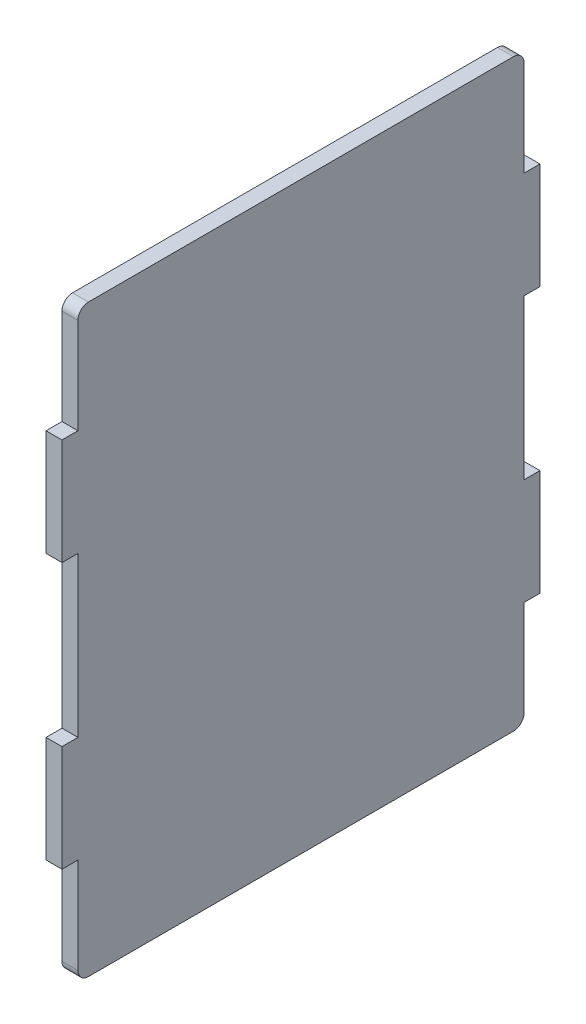
ISO-10303-21;
HEADER;
FILE_DESCRIPTION(('STEP AP214'),'2;1');
FILE_NAME('part.step','',(''),(''),'','','');
FILE_SCHEMA(('AUTOMOTIVE_DESIGN { 1 0 10303 214 1 1 1 1 }'));
ENDSEC;
DATA;
#1=APPLICATION_CONTEXT('core data for automotive mechanical design processes');
#2=APPLICATION_PROTOCOL_DEFINITION('international standard','automotive_design',2000,#1);
#3=PRODUCT_CONTEXT('',#1,'mechanical');
#4=PRODUCT('Part','Part','',(#3));
#5=PRODUCT_RELATED_PRODUCT_CATEGORY('part','',(#4));
#6=PRODUCT_DEFINITION_FORMATION('','',#4);
#7=PRODUCT_DEFINITION_CONTEXT('part definition',#1,'design');
#8=PRODUCT_DEFINITION('design','',#6,#7);
#9=PRODUCT_DEFINITION_SHAPE('','',#8);
#10=(LENGTH_UNIT() NAMED_UNIT(*) SI_UNIT(.MILLI.,.METRE.));
#11=(NAMED_UNIT(*) PLANE_ANGLE_UNIT() SI_UNIT($,.RADIAN.));
#12=(NAMED_UNIT(*) SI_UNIT($,.STERADIAN.) SOLID_ANGLE_UNIT());
#13=UNCERTAINTY_MEASURE_WITH_UNIT(LENGTH_MEASURE(1.E-05),#10,'distance_accuracy_value','');
#14=(GEOMETRIC_REPRESENTATION_CONTEXT(3) GLOBAL_UNCERTAINTY_ASSIGNED_CONTEXT((#13)) GLOBAL_UNIT_ASSIGNED_CONTEXT((#10,
#11,#12)) REPRESENTATION_CONTEXT('',''));
#15=CARTESIAN_POINT('',(0.,0.,0.));
#16=DIRECTION('',(0.,0.,1.));
#17=DIRECTION('',(1.,0.,0.));
#18=AXIS2_PLACEMENT_3D('',#15,#16,#17);
#19=CARTESIAN_POINT('',(0.,0.,1.5));
#20=DIRECTION('',(0.,0.,-1.));
#21=DIRECTION('',(-1.,0.,0.));
#22=AXIS2_PLACEMENT_3D('',#19,#20,#21);
#23=PLANE('',#22);
#24=DIRECTION('',(0.,-1.,0.));
#25=VECTOR('',#24,1.);
#26=CARTESIAN_POINT('',(-3.91489361702124,84.3977059847354,1.5));
#27=LINE('',#26,#25);
#28=CARTESIAN_POINT('',(-3.91489361702123,64.3977059847354,1.5));
#29=VERTEX_POINT('',#28);
#30=CARTESIAN_POINT('',(-3.91489361702123,44.3977059847353,1.5));
#31=VERTEX_POINT('',#30);
#32=EDGE_CURVE('E293',#29,#31,#27,.T.);
#33=ORIENTED_EDGE('',*,*,#32,.F.);
#34=DIRECTION('',(1.,0.,0.));
#35=VECTOR('',#34,1.);
#36=CARTESIAN_POINT('',(-7.00489361702124,64.3977059847354,1.5));
#37=LINE('',#36,#35);
#38=CARTESIAN_POINT('',(-6.91489361702124,64.3977059847354,1.5));
#39=VERTEX_POINT('',#38);
#40=EDGE_CURVE('E238',#39,#29,#37,.T.);
#41=ORIENTED_EDGE('',*,*,#40,.F.);
#42=DIRECTION('',(0.,-1.,0.));
#43=VECTOR('',#42,1.);
#44=CARTESIAN_POINT('',(-6.91489361702124,84.3977059847354,1.5));
#45=LINE('',#44,#43);
#46=CARTESIAN_POINT('',(-6.91489361702123,44.3977059847353,1.5));
#47=VERTEX_POINT('',#46);
#48=EDGE_CURVE('E289',#39,#47,#45,.T.);
#49=ORIENTED_EDGE('',*,*,#48,.T.);
#50=DIRECTION('',(-1.,0.,0.));
#51=VECTOR('',#50,1.);
#52=CARTESIAN_POINT('',(-3.82489361702123,44.3977059847353,1.5));
#53=LINE('',#52,#51);
#54=EDGE_CURVE('E241',#31,#47,#53,.T.);
#55=ORIENTED_EDGE('',*,*,#54,.F.);
#56=EDGE_LOOP('',(#33,#41,#49,#55));
#57=FACE_BOUND('',#56,.T.);
#58=ADVANCED_FACE('F33',(#57),#23,.F.);
#59=CARTESIAN_POINT('',(-3.91489361702121,-25.6022940152647,-198.540901486674));
#60=DIRECTION('',(0.,1.,0.));
#61=DIRECTION('',(0.,0.,1.));
#62=AXIS2_PLACEMENT_3D('',#59,#60,#61);
#63=PLANE('',#62);
#64=DIRECTION('',(0.,0.,1.));
#65=VECTOR('',#64,1.);
#66=CARTESIAN_POINT('',(-3.91489361702121,-25.6022940152647,-198.540901486674));
#67=LINE('',#66,#65);
#68=CARTESIAN_POINT('',(-3.91489361702121,-25.6022940152647,-83.5));
#69=VERTEX_POINT('',#68);
#70=CARTESIAN_POINT('',(-3.91489361702121,-25.6022940152647,-3.50000000000006));
#71=VERTEX_POINT('',#70);
#72=EDGE_CURVE('E298',#69,#71,#67,.T.);
#73=ORIENTED_EDGE('',*,*,#72,.T.);
#74=DIRECTION('',(1.,0.,0.));
#75=VECTOR('',#74,1.);
#76=CARTESIAN_POINT('',(-6.91489361702121,-25.6022940152647,-3.5));
#77=LINE('',#76,#75);
#78=CARTESIAN_POINT('',(-6.91489361702121,-25.6022940152647,-3.50000000000006));
#79=VERTEX_POINT('',#78);
#80=EDGE_CURVE('E341',#71,#79,#77,.F.);
#81=ORIENTED_EDGE('',*,*,#80,.T.);
#82=DIRECTION('',(0.,0.,1.));
#83=VECTOR('',#82,1.);
#84=CARTESIAN_POINT('',(-6.91489361702121,-25.6022940152647,-198.540901486674));
#85=LINE('',#84,#83);
#86=CARTESIAN_POINT('',(-6.91489361702121,-25.6022940152647,-83.5));
#87=VERTEX_POINT('',#86);
#88=EDGE_CURVE('E301',#87,#79,#85,.T.);
#89=ORIENTED_EDGE('',*,*,#88,.F.);
#90=DIRECTION('',(1.,0.,0.));
#91=VECTOR('',#90,1.);
#92=CARTESIAN_POINT('',(-3.91489361702121,-25.6022940152647,-83.5));
#93=LINE('',#92,#91);
#94=EDGE_CURVE('E338',#87,#69,#93,.T.);
#95=ORIENTED_EDGE('',*,*,#94,.T.);
#96=EDGE_LOOP('',(#73,#81,#89,#95));
#97=FACE_BOUND('',#96,.T.);
#98=ADVANCED_FACE('F411',(#97),#63,.F.);
#99=CARTESIAN_POINT('',(-3.91489361702124,84.3977059847354,-198.540901486674));
#100=DIRECTION('',(-1.,0.,0.));
#101=DIRECTION('',(0.,-1.,0.));
#102=AXIS2_PLACEMENT_3D('',#99,#100,#101);
#103=PLANE('',#102);
#104=DIRECTION('',(0.,1.,0.));
#105=VECTOR('',#104,1.);
#106=CARTESIAN_POINT('',(-3.91489361702123,0.,-1.5));
#107=LINE('',#106,#105);
#108=CARTESIAN_POINT('',(-3.91489361702123,-23.6022940152647,-1.5));
#109=VERTEX_POINT('',#108);
#110=CARTESIAN_POINT('',(-3.91489361702123,-5.60229401526467,-1.5));
#111=VERTEX_POINT('',#110);
#112=EDGE_CURVE('E261',#109,#111,#107,.T.);
#113=ORIENTED_EDGE('',*,*,#112,.F.);
#114=CARTESIAN_POINT('',(-3.91489361702121,-23.6022940152647,-3.5));
#115=DIRECTION('',(-1.,0.,0.));
#116=DIRECTION('',(0.,-1.,0.));
#117=AXIS2_PLACEMENT_3D('',#114,#115,#116);
#118=CIRCLE('',#117,2.);
#119=EDGE_CURVE('E336',#109,#71,#118,.F.);
#120=ORIENTED_EDGE('',*,*,#119,.T.);
#121=ORIENTED_EDGE('',*,*,#72,.F.);
#122=CARTESIAN_POINT('',(-3.91489361702121,-23.6022940152647,-83.5));
#123=DIRECTION('',(-1.,0.,0.));
#124=DIRECTION('',(0.,-1.,0.));
#125=AXIS2_PLACEMENT_3D('',#122,#123,#124);
#126=CIRCLE('',#125,2.);
#127=CARTESIAN_POINT('',(-3.9148936170212,-23.6022940152647,-85.5));
#128=VERTEX_POINT('',#127);
#129=EDGE_CURVE('E334',#69,#128,#126,.F.);
#130=ORIENTED_EDGE('',*,*,#129,.T.);
#131=DIRECTION('',(0.,1.,0.));
#132=VECTOR('',#131,1.);
#133=CARTESIAN_POINT('',(-3.91489361702121,0.,-85.5));
#134=LINE('',#133,#132);
#135=CARTESIAN_POINT('',(-3.91489361702121,-5.60229401526467,-85.5));
#136=VERTEX_POINT('',#135);
#137=EDGE_CURVE('E223',#128,#136,#134,.T.);
#138=ORIENTED_EDGE('',*,*,#137,.T.);
#139=DIRECTION('',(0.,0.,-1.));
#140=VECTOR('',#139,1.);
#141=CARTESIAN_POINT('',(-3.91489361702121,-5.60229401526467,-85.5));
#142=LINE('',#141,#140);
#143=CARTESIAN_POINT('',(-3.91489361702121,-5.60229401526467,-88.5));
#144=VERTEX_POINT('',#143);
#145=EDGE_CURVE('E227',#136,#144,#142,.T.);
#146=ORIENTED_EDGE('',*,*,#145,.T.);
#147=DIRECTION('',(0.,1.,0.));
#148=VECTOR('',#147,1.);
#149=CARTESIAN_POINT('',(-3.91489361702124,84.3977059847354,-88.5));
#150=LINE('',#149,#148);
#151=CARTESIAN_POINT('',(-3.91489361702122,14.3977059847353,-88.5));
#152=VERTEX_POINT('',#151);
#153=EDGE_CURVE('E281',#144,#152,#150,.T.);
#154=ORIENTED_EDGE('',*,*,#153,.T.);
#155=DIRECTION('',(0.,0.,1.));
#156=VECTOR('',#155,1.);
#157=CARTESIAN_POINT('',(-3.91489361702121,14.3977059847353,-85.5));
#158=LINE('',#157,#156);
#159=CARTESIAN_POINT('',(-3.91489361702121,14.3977059847353,-85.5));
#160=VERTEX_POINT('',#159);
#161=EDGE_CURVE('E222',#152,#160,#158,.T.);
#162=ORIENTED_EDGE('',*,*,#161,.T.);
#163=CARTESIAN_POINT('',(-3.91489361702121,44.3977059847353,-85.5));
#164=VERTEX_POINT('',#163);
#165=EDGE_CURVE('E201',#160,#164,#134,.T.);
#166=ORIENTED_EDGE('',*,*,#165,.T.);
#167=DIRECTION('',(0.,0.,-1.));
#168=VECTOR('',#167,1.);
#169=CARTESIAN_POINT('',(-3.91489361702121,44.3977059847353,-85.5));
#170=LINE('',#169,#168);
#171=CARTESIAN_POINT('',(-3.91489361702121,44.3977059847353,-88.5));
#172=VERTEX_POINT('',#171);
#173=EDGE_CURVE('E207',#164,#172,#170,.T.);
#174=ORIENTED_EDGE('',*,*,#173,.T.);
#175=CARTESIAN_POINT('',(-3.91489361702124,64.3977059847354,-88.5));
#176=VERTEX_POINT('',#175);
#177=EDGE_CURVE('E279',#172,#176,#150,.T.);
#178=ORIENTED_EDGE('',*,*,#177,.T.);
#179=DIRECTION('',(0.,0.,1.));
#180=VECTOR('',#179,1.);
#181=CARTESIAN_POINT('',(-3.91489361702122,64.3977059847354,-85.5));
#182=LINE('',#181,#180);
#183=CARTESIAN_POINT('',(-3.91489361702121,64.3977059847354,-85.5));
#184=VERTEX_POINT('',#183);
#185=EDGE_CURVE('E217',#176,#184,#182,.T.);
#186=ORIENTED_EDGE('',*,*,#185,.T.);
#187=CARTESIAN_POINT('',(-3.91489361702122,82.3977059847354,-85.5));
#188=VERTEX_POINT('',#187);
#189=EDGE_CURVE('E224',#184,#188,#134,.T.);
#190=ORIENTED_EDGE('',*,*,#189,.T.);
#191=CARTESIAN_POINT('',(-3.91489361702124,82.3977059847354,-83.5));
#192=DIRECTION('',(-1.,0.,0.));
#193=DIRECTION('',(0.,-1.,0.));
#194=AXIS2_PLACEMENT_3D('',#191,#192,#193);
#195=CIRCLE('',#194,2.);
#196=CARTESIAN_POINT('',(-3.91489361702124,84.3977059847354,-83.5));
#197=VERTEX_POINT('',#196);
#198=EDGE_CURVE('E332',#188,#197,#195,.F.);
#199=ORIENTED_EDGE('',*,*,#198,.T.);
#200=DIRECTION('',(0.,0.,1.));
#201=VECTOR('',#200,1.);
#202=CARTESIAN_POINT('',(-3.91489361702124,84.3977059847354,-198.540901486674));
#203=LINE('',#202,#201);
#204=CARTESIAN_POINT('',(-3.91489361702124,84.3977059847354,-3.50000000000006));
#205=VERTEX_POINT('',#204);
#206=EDGE_CURVE('E295',#197,#205,#203,.T.);
#207=ORIENTED_EDGE('',*,*,#206,.T.);
#208=CARTESIAN_POINT('',(-3.91489361702124,82.3977059847354,-3.5));
#209=DIRECTION('',(-1.,0.,0.));
#210=DIRECTION('',(0.,-1.,0.));
#211=AXIS2_PLACEMENT_3D('',#208,#209,#210);
#212=CIRCLE('',#211,2.);
#213=CARTESIAN_POINT('',(-3.91489361702124,82.3977059847354,-1.5));
#214=VERTEX_POINT('',#213);
#215=EDGE_CURVE('E330',#205,#214,#212,.F.);
#216=ORIENTED_EDGE('',*,*,#215,.T.);
#217=CARTESIAN_POINT('',(-3.91489361702123,64.3977059847354,-1.5));
#218=VERTEX_POINT('',#217);
#219=EDGE_CURVE('E260',#218,#214,#107,.T.);
#220=ORIENTED_EDGE('',*,*,#219,.F.);
#221=DIRECTION('',(0.,0.,1.));
#222=VECTOR('',#221,1.);
#223=CARTESIAN_POINT('',(-3.91489361702124,64.3977059847354,1.5));
#224=LINE('',#223,#222);
#225=EDGE_CURVE('E251',#218,#29,#224,.T.);
#226=ORIENTED_EDGE('',*,*,#225,.T.);
#227=ORIENTED_EDGE('',*,*,#32,.T.);
#228=DIRECTION('',(0.,0.,-1.));
#229=VECTOR('',#228,1.);
#230=CARTESIAN_POINT('',(-3.91489361702123,44.3977059847353,1.5));
#231=LINE('',#230,#229);
#232=CARTESIAN_POINT('',(-3.91489361702123,44.3977059847353,-1.5));
#233=VERTEX_POINT('',#232);
#234=EDGE_CURVE('E243',#31,#233,#231,.T.);
#235=ORIENTED_EDGE('',*,*,#234,.T.);
#236=CARTESIAN_POINT('',(-3.91489361702123,14.3977059847353,-1.5));
#237=VERTEX_POINT('',#236);
#238=EDGE_CURVE('E264',#237,#233,#107,.T.);
#239=ORIENTED_EDGE('',*,*,#238,.F.);
#240=DIRECTION('',(0.,0.,1.));
#241=VECTOR('',#240,1.);
#242=CARTESIAN_POINT('',(-3.91489361702123,14.3977059847353,1.5));
#243=LINE('',#242,#241);
#244=CARTESIAN_POINT('',(-3.91489361702123,14.3977059847353,1.5));
#245=VERTEX_POINT('',#244);
#246=EDGE_CURVE('E254',#237,#245,#243,.T.);
#247=ORIENTED_EDGE('',*,*,#246,.T.);
#248=CARTESIAN_POINT('',(-3.91489361702123,-5.60229401526467,1.5));
#249=VERTEX_POINT('',#248);
#250=EDGE_CURVE('E290',#245,#249,#27,.T.);
#251=ORIENTED_EDGE('',*,*,#250,.T.);
#252=DIRECTION('',(0.,0.,-1.));
#253=VECTOR('',#252,1.);
#254=CARTESIAN_POINT('',(-3.91489361702123,-5.60229401526467,1.5));
#255=LINE('',#254,#253);
#256=EDGE_CURVE('E257',#249,#111,#255,.T.);
#257=ORIENTED_EDGE('',*,*,#256,.T.);
#258=EDGE_LOOP('',(#113,#120,#121,#130,#138,#146,#154,#162,#166,#174,#178,#186,#190,#199,#207,
#216,#220,#226,#227,#235,#239,#247,#251,#257));
#259=FACE_BOUND('',#258,.T.);
#260=ADVANCED_FACE('F220',(#259),#103,.F.);
#261=CARTESIAN_POINT('',(-6.91489361702124,84.3977059847354,-198.540901486674));
#262=DIRECTION('',(0.,-1.,0.));
#263=DIRECTION('',(0.,0.,-1.));
#264=AXIS2_PLACEMENT_3D('',#261,#262,#263);
#265=PLANE('',#264);
#266=ORIENTED_EDGE('',*,*,#206,.F.);
#267=DIRECTION('',(-1.,0.,0.));
#268=VECTOR('',#267,1.);
#269=CARTESIAN_POINT('',(-6.91489361702124,84.3977059847354,-83.5));
#270=LINE('',#269,#268);
#271=CARTESIAN_POINT('',(-6.91489361702124,84.3977059847354,-83.5));
#272=VERTEX_POINT('',#271);
#273=EDGE_CURVE('E353',#197,#272,#270,.T.);
#274=ORIENTED_EDGE('',*,*,#273,.T.);
#275=DIRECTION('',(0.,0.,1.));
#276=VECTOR('',#275,1.);
#277=CARTESIAN_POINT('',(-6.91489361702124,84.3977059847354,-198.540901486674));
#278=LINE('',#277,#276);
#279=CARTESIAN_POINT('',(-6.91489361702124,84.3977059847354,-3.50000000000006));
#280=VERTEX_POINT('',#279);
#281=EDGE_CURVE('E282',#272,#280,#278,.T.);
#282=ORIENTED_EDGE('',*,*,#281,.T.);
#283=DIRECTION('',(-1.,0.,0.));
#284=VECTOR('',#283,1.);
#285=CARTESIAN_POINT('',(-3.91489361702124,84.3977059847354,-3.5));
#286=LINE('',#285,#284);
#287=EDGE_CURVE('E351',#280,#205,#286,.F.);
#288=ORIENTED_EDGE('',*,*,#287,.T.);
#289=EDGE_LOOP('',(#266,#274,#282,#288));
#290=FACE_BOUND('',#289,.T.);
#291=ADVANCED_FACE('F365',(#290),#265,.F.);
#292=CARTESIAN_POINT('',(-6.91489361702124,84.3977059847354,-198.540901486674));
#293=DIRECTION('',(-1.,0.,0.));
#294=DIRECTION('',(0.,-1.,0.));
#295=AXIS2_PLACEMENT_3D('',#292,#293,#294);
#296=PLANE('',#295);
#297=ORIENTED_EDGE('',*,*,#88,.T.);
#298=CARTESIAN_POINT('',(-6.91489361702121,-23.6022940152647,-3.5));
#299=DIRECTION('',(-1.,0.,0.));
#300=DIRECTION('',(0.,-1.,0.));
#301=AXIS2_PLACEMENT_3D('',#298,#299,#300);
#302=CIRCLE('',#301,2.);
#303=CARTESIAN_POINT('',(-6.91489361702121,-23.6022940152647,-1.5));
#304=VERTEX_POINT('',#303);
#305=EDGE_CURVE('E347',#79,#304,#302,.T.);
#306=ORIENTED_EDGE('',*,*,#305,.T.);
#307=DIRECTION('',(0.,1.,0.));
#308=VECTOR('',#307,1.);
#309=CARTESIAN_POINT('',(-6.91489361702124,84.3977059847354,-1.5));
#310=LINE('',#309,#308);
#311=CARTESIAN_POINT('',(-6.91489361702122,-5.60229401526467,-1.5));
#312=VERTEX_POINT('',#311);
#313=EDGE_CURVE('E316',#304,#312,#310,.T.);
#314=ORIENTED_EDGE('',*,*,#313,.T.);
#315=DIRECTION('',(0.,0.,-1.));
#316=VECTOR('',#315,1.);
#317=CARTESIAN_POINT('',(-6.91489361702122,-5.60229401526467,-198.540901486674));
#318=LINE('',#317,#316);
#319=CARTESIAN_POINT('',(-6.91489361702122,-5.60229401526467,1.5));
#320=VERTEX_POINT('',#319);
#321=EDGE_CURVE('E319',#320,#312,#318,.T.);
#322=ORIENTED_EDGE('',*,*,#321,.F.);
#323=CARTESIAN_POINT('',(-6.91489361702122,14.3977059847353,1.5));
#324=VERTEX_POINT('',#323);
#325=EDGE_CURVE('E278',#324,#320,#45,.T.);
#326=ORIENTED_EDGE('',*,*,#325,.F.);
#327=DIRECTION('',(0.,0.,1.));
#328=VECTOR('',#327,1.);
#329=CARTESIAN_POINT('',(-6.91489361702122,14.3977059847353,-198.540901486674));
#330=LINE('',#329,#328);
#331=CARTESIAN_POINT('',(-6.91489361702122,14.3977059847353,-1.5));
#332=VERTEX_POINT('',#331);
#333=EDGE_CURVE('E310',#332,#324,#330,.T.);
#334=ORIENTED_EDGE('',*,*,#333,.F.);
#335=CARTESIAN_POINT('',(-6.91489361702123,44.3977059847353,-1.5));
#336=VERTEX_POINT('',#335);
#337=EDGE_CURVE('E312',#332,#336,#310,.T.);
#338=ORIENTED_EDGE('',*,*,#337,.T.);
#339=DIRECTION('',(0.,0.,-1.));
#340=VECTOR('',#339,1.);
#341=CARTESIAN_POINT('',(-6.91489361702123,44.3977059847353,-198.540901486674));
#342=LINE('',#341,#340);
#343=EDGE_CURVE('E315',#47,#336,#342,.T.);
#344=ORIENTED_EDGE('',*,*,#343,.F.);
#345=ORIENTED_EDGE('',*,*,#48,.F.);
#346=DIRECTION('',(0.,0.,1.));
#347=VECTOR('',#346,1.);
#348=CARTESIAN_POINT('',(-6.91489361702124,64.3977059847354,-198.540901486674));
#349=LINE('',#348,#347);
#350=CARTESIAN_POINT('',(-6.91489361702124,64.3977059847354,-1.5));
#351=VERTEX_POINT('',#350);
#352=EDGE_CURVE('E322',#351,#39,#349,.T.);
#353=ORIENTED_EDGE('',*,*,#352,.F.);
#354=CARTESIAN_POINT('',(-6.91489361702124,82.3977059847354,-1.5));
#355=VERTEX_POINT('',#354);
#356=EDGE_CURVE('E317',#351,#355,#310,.T.);
#357=ORIENTED_EDGE('',*,*,#356,.T.);
#358=CARTESIAN_POINT('',(-6.91489361702124,82.3977059847354,-3.5));
#359=DIRECTION('',(-1.,0.,0.));
#360=DIRECTION('',(0.,-1.,0.));
#361=AXIS2_PLACEMENT_3D('',#358,#359,#360);
#362=CIRCLE('',#361,2.);
#363=EDGE_CURVE('E48',#355,#280,#362,.T.);
#364=ORIENTED_EDGE('',*,*,#363,.T.);
#365=ORIENTED_EDGE('',*,*,#281,.F.);
#366=CARTESIAN_POINT('',(-6.91489361702124,82.3977059847354,-83.5));
#367=DIRECTION('',(-1.,0.,0.));
#368=DIRECTION('',(0.,-1.,0.));
#369=AXIS2_PLACEMENT_3D('',#366,#367,#368);
#370=CIRCLE('',#369,2.);
#371=CARTESIAN_POINT('',(-6.91489361702124,82.3977059847354,-85.5));
#372=VERTEX_POINT('',#371);
#373=EDGE_CURVE('E56',#272,#372,#370,.T.);
#374=ORIENTED_EDGE('',*,*,#373,.T.);
#375=DIRECTION('',(0.,1.,0.));
#376=VECTOR('',#375,1.);
#377=CARTESIAN_POINT('',(-6.91489361702124,84.3977059847354,-85.5));
#378=LINE('',#377,#376);
#379=CARTESIAN_POINT('',(-6.91489361702124,64.3977059847354,-85.5));
#380=VERTEX_POINT('',#379);
#381=EDGE_CURVE('E326',#380,#372,#378,.T.);
#382=ORIENTED_EDGE('',*,*,#381,.F.);
#383=DIRECTION('',(0.,0.,1.));
#384=VECTOR('',#383,1.);
#385=CARTESIAN_POINT('',(-6.91489361702124,64.3977059847354,-198.540901486674));
#386=LINE('',#385,#384);
#387=CARTESIAN_POINT('',(-6.91489361702124,64.3977059847354,-88.5));
#388=VERTEX_POINT('',#387);
#389=EDGE_CURVE('E276',#388,#380,#386,.T.);
#390=ORIENTED_EDGE('',*,*,#389,.F.);
#391=DIRECTION('',(0.,1.,0.));
#392=VECTOR('',#391,1.);
#393=CARTESIAN_POINT('',(-6.91489361702124,84.3977059847354,-88.5));
#394=LINE('',#393,#392);
#395=CARTESIAN_POINT('',(-6.91489361702124,44.3977059847353,-88.5));
#396=VERTEX_POINT('',#395);
#397=EDGE_CURVE('E283',#396,#388,#394,.T.);
#398=ORIENTED_EDGE('',*,*,#397,.F.);
#399=DIRECTION('',(0.,0.,-1.));
#400=VECTOR('',#399,1.);
#401=CARTESIAN_POINT('',(-6.91489361702123,44.3977059847353,-198.540901486674));
#402=LINE('',#401,#400);
#403=CARTESIAN_POINT('',(-6.91489361702123,44.3977059847353,-85.5));
#404=VERTEX_POINT('',#403);
#405=EDGE_CURVE('E274',#404,#396,#402,.T.);
#406=ORIENTED_EDGE('',*,*,#405,.F.);
#407=CARTESIAN_POINT('',(-6.91489361702122,14.3977059847353,-85.5));
#408=VERTEX_POINT('',#407);
#409=EDGE_CURVE('E204',#408,#404,#378,.T.);
#410=ORIENTED_EDGE('',*,*,#409,.F.);
#411=DIRECTION('',(0.,0.,1.));
#412=VECTOR('',#411,1.);
#413=CARTESIAN_POINT('',(-6.91489361702122,14.3977059847353,-198.540901486674));
#414=LINE('',#413,#412);
#415=CARTESIAN_POINT('',(-6.91489361702124,14.3977059847353,-88.5));
#416=VERTEX_POINT('',#415);
#417=EDGE_CURVE('E235',#416,#408,#414,.T.);
#418=ORIENTED_EDGE('',*,*,#417,.F.);
#419=CARTESIAN_POINT('',(-6.91489361702122,-5.60229401526467,-88.5));
#420=VERTEX_POINT('',#419);
#421=EDGE_CURVE('E286',#420,#416,#394,.T.);
#422=ORIENTED_EDGE('',*,*,#421,.F.);
#423=DIRECTION('',(0.,0.,-1.));
#424=VECTOR('',#423,1.);
#425=CARTESIAN_POINT('',(-6.91489361702122,-5.60229401526467,-198.540901486674));
#426=LINE('',#425,#424);
#427=CARTESIAN_POINT('',(-6.91489361702121,-5.60229401526467,-85.5));
#428=VERTEX_POINT('',#427);
#429=EDGE_CURVE('E272',#428,#420,#426,.T.);
#430=ORIENTED_EDGE('',*,*,#429,.F.);
#431=CARTESIAN_POINT('',(-6.91489361702121,-23.6022940152647,-85.5));
#432=VERTEX_POINT('',#431);
#433=EDGE_CURVE('E325',#432,#428,#378,.T.);
#434=ORIENTED_EDGE('',*,*,#433,.F.);
#435=CARTESIAN_POINT('',(-6.91489361702121,-23.6022940152647,-83.5));
#436=DIRECTION('',(-1.,0.,0.));
#437=DIRECTION('',(0.,-1.,0.));
#438=AXIS2_PLACEMENT_3D('',#435,#436,#437);
#439=CIRCLE('',#438,2.);
#440=EDGE_CURVE('E345',#432,#87,#439,.T.);
#441=ORIENTED_EDGE('',*,*,#440,.T.);
#442=EDGE_LOOP('',(#297,#306,#314,#322,#326,#334,#338,#344,#345,#353,#357,#364,#365,#374,#382,
#390,#398,#406,#410,#418,#422,#430,#434,#441));
#443=FACE_BOUND('',#442,.T.);
#444=ADVANCED_FACE('F367',(#443),#296,.T.);
#445=CARTESIAN_POINT('',(0.,0.,-88.5));
#446=DIRECTION('',(0.,0.,1.));
#447=DIRECTION('',(1.,0.,0.));
#448=AXIS2_PLACEMENT_3D('',#445,#446,#447);
#449=PLANE('',#448);
#450=ORIENTED_EDGE('',*,*,#397,.T.);
#451=DIRECTION('',(1.,0.,0.));
#452=VECTOR('',#451,1.);
#453=CARTESIAN_POINT('',(0.,64.3977059847354,-88.5));
#454=LINE('',#453,#452);
#455=EDGE_CURVE('E307',#388,#176,#454,.T.);
#456=ORIENTED_EDGE('',*,*,#455,.T.);
#457=ORIENTED_EDGE('',*,*,#177,.F.);
#458=DIRECTION('',(-1.,0.,0.));
#459=VECTOR('',#458,1.);
#460=CARTESIAN_POINT('',(0.,44.3977059847353,-88.5));
#461=LINE('',#460,#459);
#462=EDGE_CURVE('E213',#172,#396,#461,.T.);
#463=ORIENTED_EDGE('',*,*,#462,.T.);
#464=EDGE_LOOP('',(#450,#456,#457,#463));
#465=FACE_BOUND('',#464,.T.);
#466=ADVANCED_FACE('F397',(#465),#449,.F.);
#467=ORIENTED_EDGE('',*,*,#325,.T.);
#468=DIRECTION('',(-1.,0.,0.));
#469=VECTOR('',#468,1.);
#470=CARTESIAN_POINT('',(-3.82489361702124,-5.60229401526467,1.5));
#471=LINE('',#470,#469);
#472=EDGE_CURVE('E246',#249,#320,#471,.T.);
#473=ORIENTED_EDGE('',*,*,#472,.F.);
#474=ORIENTED_EDGE('',*,*,#250,.F.);
#475=DIRECTION('',(1.,0.,0.));
#476=VECTOR('',#475,1.);
#477=CARTESIAN_POINT('',(-7.00489361702123,14.3977059847353,1.5));
#478=LINE('',#477,#476);
#479=EDGE_CURVE('E239',#324,#245,#478,.T.);
#480=ORIENTED_EDGE('',*,*,#479,.F.);
#481=EDGE_LOOP('',(#467,#473,#474,#480));
#482=FACE_BOUND('',#481,.T.);
#483=ADVANCED_FACE('F399',(#482),#23,.F.);
#484=ORIENTED_EDGE('',*,*,#153,.F.);
#485=DIRECTION('',(-1.,0.,0.));
#486=VECTOR('',#485,1.);
#487=CARTESIAN_POINT('',(0.,-5.60229401526467,-88.5));
#488=LINE('',#487,#486);
#489=EDGE_CURVE('E232',#144,#420,#488,.T.);
#490=ORIENTED_EDGE('',*,*,#489,.T.);
#491=ORIENTED_EDGE('',*,*,#421,.T.);
#492=DIRECTION('',(1.,0.,0.));
#493=VECTOR('',#492,1.);
#494=CARTESIAN_POINT('',(0.,14.3977059847353,-88.5));
#495=LINE('',#494,#493);
#496=EDGE_CURVE('E304',#416,#152,#495,.T.);
#497=ORIENTED_EDGE('',*,*,#496,.T.);
#498=EDGE_LOOP('',(#484,#490,#491,#497));
#499=FACE_BOUND('',#498,.T.);
#500=ADVANCED_FACE('F390',(#499),#449,.F.);
#501=CARTESIAN_POINT('',(-3.82489361702121,44.3977059847353,-88.5));
#502=DIRECTION('',(0.,1.,0.));
#503=DIRECTION('',(0.,0.,1.));
#504=AXIS2_PLACEMENT_3D('',#501,#502,#503);
#505=PLANE('',#504);
#506=ORIENTED_EDGE('',*,*,#405,.T.);
#507=ORIENTED_EDGE('',*,*,#462,.F.);
#508=ORIENTED_EDGE('',*,*,#173,.F.);
#509=DIRECTION('',(-1.,0.,0.));
#510=VECTOR('',#509,1.);
#511=CARTESIAN_POINT('',(-3.82489361702121,44.3977059847353,-85.5));
#512=LINE('',#511,#510);
#513=EDGE_CURVE('E196',#164,#404,#512,.T.);
#514=ORIENTED_EDGE('',*,*,#513,.T.);
#515=EDGE_LOOP('',(#506,#507,#508,#514));
#516=FACE_BOUND('',#515,.T.);
#517=ADVANCED_FACE('F211',(#516),#505,.F.);
#518=CARTESIAN_POINT('',(-7.00489361702121,14.3977059847353,-88.5));
#519=DIRECTION('',(0.,-1.,0.));
#520=DIRECTION('',(0.,0.,-1.));
#521=AXIS2_PLACEMENT_3D('',#518,#519,#520);
#522=PLANE('',#521);
#523=ORIENTED_EDGE('',*,*,#417,.T.);
#524=DIRECTION('',(1.,0.,0.));
#525=VECTOR('',#524,1.);
#526=CARTESIAN_POINT('',(-7.00489361702121,14.3977059847353,-85.5));
#527=LINE('',#526,#525);
#528=EDGE_CURVE('E383',#408,#160,#527,.T.);
#529=ORIENTED_EDGE('',*,*,#528,.T.);
#530=ORIENTED_EDGE('',*,*,#161,.F.);
#531=ORIENTED_EDGE('',*,*,#496,.F.);
#532=EDGE_LOOP('',(#523,#529,#530,#531));
#533=FACE_BOUND('',#532,.T.);
#534=ADVANCED_FACE('F503',(#533),#522,.F.);
#535=CARTESIAN_POINT('',(0.,0.,-85.5));
#536=DIRECTION('',(0.,0.,1.));
#537=DIRECTION('',(1.,0.,0.));
#538=AXIS2_PLACEMENT_3D('',#535,#536,#537);
#539=PLANE('',#538);
#540=ORIENTED_EDGE('',*,*,#409,.T.);
#541=ORIENTED_EDGE('',*,*,#513,.F.);
#542=ORIENTED_EDGE('',*,*,#165,.F.);
#543=ORIENTED_EDGE('',*,*,#528,.F.);
#544=EDGE_LOOP('',(#540,#541,#542,#543));
#545=FACE_BOUND('',#544,.T.);
#546=ADVANCED_FACE('F198',(#545),#539,.F.);
#547=CARTESIAN_POINT('',(-3.82489361702122,-5.60229401526467,-88.5));
#548=DIRECTION('',(0.,1.,0.));
#549=DIRECTION('',(0.,0.,1.));
#550=AXIS2_PLACEMENT_3D('',#547,#548,#549);
#551=PLANE('',#550);
#552=ORIENTED_EDGE('',*,*,#429,.T.);
#553=ORIENTED_EDGE('',*,*,#489,.F.);
#554=ORIENTED_EDGE('',*,*,#145,.F.);
#555=DIRECTION('',(-1.,0.,0.));
#556=VECTOR('',#555,1.);
#557=CARTESIAN_POINT('',(-3.82489361702122,-5.60229401526467,-85.5));
#558=LINE('',#557,#556);
#559=EDGE_CURVE('E270',#136,#428,#558,.T.);
#560=ORIENTED_EDGE('',*,*,#559,.T.);
#561=EDGE_LOOP('',(#552,#553,#554,#560));
#562=FACE_BOUND('',#561,.T.);
#563=ADVANCED_FACE('F381',(#562),#551,.F.);
#564=ORIENTED_EDGE('',*,*,#137,.F.);
#565=DIRECTION('',(1.,0.,0.));
#566=VECTOR('',#565,1.);
#567=CARTESIAN_POINT('',(0.,-23.6022940152647,-85.5));
#568=LINE('',#567,#566);
#569=EDGE_CURVE('E349',#128,#432,#568,.F.);
#570=ORIENTED_EDGE('',*,*,#569,.T.);
#571=ORIENTED_EDGE('',*,*,#433,.T.);
#572=ORIENTED_EDGE('',*,*,#559,.F.);
#573=EDGE_LOOP('',(#564,#570,#571,#572));
#574=FACE_BOUND('',#573,.T.);
#575=ADVANCED_FACE('F375',(#574),#539,.F.);
#576=ORIENTED_EDGE('',*,*,#381,.T.);
#577=DIRECTION('',(-1.,0.,0.));
#578=VECTOR('',#577,1.);
#579=CARTESIAN_POINT('',(0.,82.3977059847354,-85.5));
#580=LINE('',#579,#578);
#581=EDGE_CURVE('E41',#372,#188,#580,.F.);
#582=ORIENTED_EDGE('',*,*,#581,.T.);
#583=ORIENTED_EDGE('',*,*,#189,.F.);
#584=DIRECTION('',(1.,0.,0.));
#585=VECTOR('',#584,1.);
#586=CARTESIAN_POINT('',(-7.00489361702122,64.3977059847354,-85.5));
#587=LINE('',#586,#585);
#588=EDGE_CURVE('E208',#380,#184,#587,.T.);
#589=ORIENTED_EDGE('',*,*,#588,.F.);
#590=EDGE_LOOP('',(#576,#582,#583,#589));
#591=FACE_BOUND('',#590,.T.);
#592=ADVANCED_FACE('F357',(#591),#539,.F.);
#593=CARTESIAN_POINT('',(-7.00489361702122,64.3977059847354,-88.5));
#594=DIRECTION('',(0.,-1.,0.));
#595=DIRECTION('',(0.,0.,-1.));
#596=AXIS2_PLACEMENT_3D('',#593,#594,#595);
#597=PLANE('',#596);
#598=ORIENTED_EDGE('',*,*,#389,.T.);
#599=ORIENTED_EDGE('',*,*,#588,.T.);
#600=ORIENTED_EDGE('',*,*,#185,.F.);
#601=ORIENTED_EDGE('',*,*,#455,.F.);
#602=EDGE_LOOP('',(#598,#599,#600,#601));
#603=FACE_BOUND('',#602,.T.);
#604=ADVANCED_FACE('F395',(#603),#597,.F.);
#605=CARTESIAN_POINT('',(-3.82489361702123,44.3977059847353,-1.5));
#606=DIRECTION('',(0.,1.,0.));
#607=DIRECTION('',(0.,0.,1.));
#608=AXIS2_PLACEMENT_3D('',#605,#606,#607);
#609=PLANE('',#608);
#610=ORIENTED_EDGE('',*,*,#343,.T.);
#611=DIRECTION('',(-1.,0.,0.));
#612=VECTOR('',#611,1.);
#613=CARTESIAN_POINT('',(0.,44.3977059847353,-1.5));
#614=LINE('',#613,#612);
#615=EDGE_CURVE('E263',#233,#336,#614,.T.);
#616=ORIENTED_EDGE('',*,*,#615,.F.);
#617=ORIENTED_EDGE('',*,*,#234,.F.);
#618=ORIENTED_EDGE('',*,*,#54,.T.);
#619=EDGE_LOOP('',(#610,#616,#617,#618));
#620=FACE_BOUND('',#619,.T.);
#621=ADVANCED_FACE('F456',(#620),#609,.F.);
#622=CARTESIAN_POINT('',(-7.00489361702123,14.3977059847353,-1.5));
#623=DIRECTION('',(0.,-1.,0.));
#624=DIRECTION('',(0.,0.,-1.));
#625=AXIS2_PLACEMENT_3D('',#622,#623,#624);
#626=PLANE('',#625);
#627=ORIENTED_EDGE('',*,*,#333,.T.);
#628=ORIENTED_EDGE('',*,*,#479,.T.);
#629=ORIENTED_EDGE('',*,*,#246,.F.);
#630=DIRECTION('',(1.,0.,0.));
#631=VECTOR('',#630,1.);
#632=CARTESIAN_POINT('',(-7.00489361702123,14.3977059847353,-1.5));
#633=LINE('',#632,#631);
#634=EDGE_CURVE('E244',#332,#237,#633,.T.);
#635=ORIENTED_EDGE('',*,*,#634,.F.);
#636=EDGE_LOOP('',(#627,#628,#629,#635));
#637=FACE_BOUND('',#636,.T.);
#638=ADVANCED_FACE('F467',(#637),#626,.F.);
#639=CARTESIAN_POINT('',(0.,0.,-1.5));
#640=DIRECTION('',(0.,0.,1.));
#641=DIRECTION('',(1.,0.,0.));
#642=AXIS2_PLACEMENT_3D('',#639,#640,#641);
#643=PLANE('',#642);
#644=ORIENTED_EDGE('',*,*,#634,.T.);
#645=ORIENTED_EDGE('',*,*,#238,.T.);
#646=ORIENTED_EDGE('',*,*,#615,.T.);
#647=ORIENTED_EDGE('',*,*,#337,.F.);
#648=EDGE_LOOP('',(#644,#645,#646,#647));
#649=FACE_BOUND('',#648,.T.);
#650=ADVANCED_FACE('F450',(#649),#643,.T.);
#651=CARTESIAN_POINT('',(-3.82489361702124,-5.60229401526467,-1.5));
#652=DIRECTION('',(0.,1.,0.));
#653=DIRECTION('',(0.,0.,1.));
#654=AXIS2_PLACEMENT_3D('',#651,#652,#653);
#655=PLANE('',#654);
#656=ORIENTED_EDGE('',*,*,#321,.T.);
#657=DIRECTION('',(-1.,0.,0.));
#658=VECTOR('',#657,1.);
#659=CARTESIAN_POINT('',(0.,-5.60229401526467,-1.5));
#660=LINE('',#659,#658);
#661=EDGE_CURVE('E267',#111,#312,#660,.T.);
#662=ORIENTED_EDGE('',*,*,#661,.F.);
#663=ORIENTED_EDGE('',*,*,#256,.F.);
#664=ORIENTED_EDGE('',*,*,#472,.T.);
#665=EDGE_LOOP('',(#656,#662,#663,#664));
#666=FACE_BOUND('',#665,.T.);
#667=ADVANCED_FACE('F472',(#666),#655,.F.);
#668=ORIENTED_EDGE('',*,*,#313,.F.);
#669=DIRECTION('',(1.,0.,0.));
#670=VECTOR('',#669,1.);
#671=CARTESIAN_POINT('',(-3.91489361702122,-23.6022940152647,-1.5));
#672=LINE('',#671,#670);
#673=EDGE_CURVE('E327',#304,#109,#672,.T.);
#674=ORIENTED_EDGE('',*,*,#673,.T.);
#675=ORIENTED_EDGE('',*,*,#112,.T.);
#676=ORIENTED_EDGE('',*,*,#661,.T.);
#677=EDGE_LOOP('',(#668,#674,#675,#676));
#678=FACE_BOUND('',#677,.T.);
#679=ADVANCED_FACE('F475',(#678),#643,.T.);
#680=ORIENTED_EDGE('',*,*,#219,.T.);
#681=DIRECTION('',(-1.,0.,0.));
#682=VECTOR('',#681,1.);
#683=CARTESIAN_POINT('',(-6.91489361702124,82.3977059847354,-1.5));
#684=LINE('',#683,#682);
#685=EDGE_CURVE('E11',#214,#355,#684,.T.);
#686=ORIENTED_EDGE('',*,*,#685,.T.);
#687=ORIENTED_EDGE('',*,*,#356,.F.);
#688=DIRECTION('',(1.,0.,0.));
#689=VECTOR('',#688,1.);
#690=CARTESIAN_POINT('',(-7.00489361702124,64.3977059847354,-1.5));
#691=LINE('',#690,#689);
#692=EDGE_CURVE('E236',#351,#218,#691,.T.);
#693=ORIENTED_EDGE('',*,*,#692,.T.);
#694=EDGE_LOOP('',(#680,#686,#687,#693));
#695=FACE_BOUND('',#694,.T.);
#696=ADVANCED_FACE('F444',(#695),#643,.T.);
#697=CARTESIAN_POINT('',(-7.00489361702124,64.3977059847354,-1.5));
#698=DIRECTION('',(0.,-1.,0.));
#699=DIRECTION('',(0.,0.,-1.));
#700=AXIS2_PLACEMENT_3D('',#697,#698,#699);
#701=PLANE('',#700);
#702=ORIENTED_EDGE('',*,*,#352,.T.);
#703=ORIENTED_EDGE('',*,*,#40,.T.);
#704=ORIENTED_EDGE('',*,*,#225,.F.);
#705=ORIENTED_EDGE('',*,*,#692,.F.);
#706=EDGE_LOOP('',(#702,#703,#704,#705));
#707=FACE_BOUND('',#706,.T.);
#708=ADVANCED_FACE('F428',(#707),#701,.F.);
#709=CARTESIAN_POINT('',(0.,-23.6022940152647,-3.5));
#710=DIRECTION('',(-1.,0.,0.));
#711=DIRECTION('',(0.,0.,1.));
#712=AXIS2_PLACEMENT_3D('',#709,#710,#711);
#713=CYLINDRICAL_SURFACE('',#712,2.);
#714=ORIENTED_EDGE('',*,*,#305,.F.);
#715=ORIENTED_EDGE('',*,*,#80,.F.);
#716=ORIENTED_EDGE('',*,*,#119,.F.);
#717=ORIENTED_EDGE('',*,*,#673,.F.);
#718=EDGE_LOOP('',(#714,#715,#716,#717));
#719=FACE_BOUND('',#718,.T.);
#720=ADVANCED_FACE('F424',(#719),#713,.T.);
#721=CARTESIAN_POINT('',(-3.91489361702121,-23.6022940152647,-83.5));
#722=DIRECTION('',(1.,0.,0.));
#723=DIRECTION('',(0.,0.,-1.));
#724=AXIS2_PLACEMENT_3D('',#721,#722,#723);
#725=CYLINDRICAL_SURFACE('',#724,2.);
#726=ORIENTED_EDGE('',*,*,#440,.F.);
#727=ORIENTED_EDGE('',*,*,#569,.F.);
#728=ORIENTED_EDGE('',*,*,#129,.F.);
#729=ORIENTED_EDGE('',*,*,#94,.F.);
#730=EDGE_LOOP('',(#726,#727,#728,#729));
#731=FACE_BOUND('',#730,.T.);
#732=ADVANCED_FACE('F427',(#731),#725,.T.);
#733=CARTESIAN_POINT('',(-6.91489361702124,82.3977059847354,-83.5));
#734=DIRECTION('',(-1.,0.,0.));
#735=DIRECTION('',(0.,0.,1.));
#736=AXIS2_PLACEMENT_3D('',#733,#734,#735);
#737=CYLINDRICAL_SURFACE('',#736,2.);
#738=ORIENTED_EDGE('',*,*,#198,.F.);
#739=ORIENTED_EDGE('',*,*,#581,.F.);
#740=ORIENTED_EDGE('',*,*,#373,.F.);
#741=ORIENTED_EDGE('',*,*,#273,.F.);
#742=EDGE_LOOP('',(#738,#739,#740,#741));
#743=FACE_BOUND('',#742,.T.);
#744=ADVANCED_FACE('F363',(#743),#737,.T.);
#745=CARTESIAN_POINT('',(0.,82.3977059847354,-3.5));
#746=DIRECTION('',(1.,0.,0.));
#747=DIRECTION('',(0.,0.,-1.));
#748=AXIS2_PLACEMENT_3D('',#745,#746,#747);
#749=CYLINDRICAL_SURFACE('',#748,2.);
#750=ORIENTED_EDGE('',*,*,#215,.F.);
#751=ORIENTED_EDGE('',*,*,#287,.F.);
#752=ORIENTED_EDGE('',*,*,#363,.F.);
#753=ORIENTED_EDGE('',*,*,#685,.F.);
#754=EDGE_LOOP('',(#750,#751,#752,#753));
#755=FACE_BOUND('',#754,.T.);
#756=ADVANCED_FACE('F35',(#755),#749,.T.);
#757=CLOSED_SHELL('',(#58,#98,#260,#291,#444,#466,#483,#500,#517,#534,#546,#563,#575,#592,#604,
#621,#638,#650,#667,#679,#696,#708,#720,#732,#744,#756));
#758=MANIFOLD_SOLID_BREP('B2',#757);
#759=ADVANCED_BREP_SHAPE_REPRESENTATION('',(#18,#758),#14);
#760=SHAPE_DEFINITION_REPRESENTATION(#9,#759);
ENDSEC;
END-ISO-10303-21;
